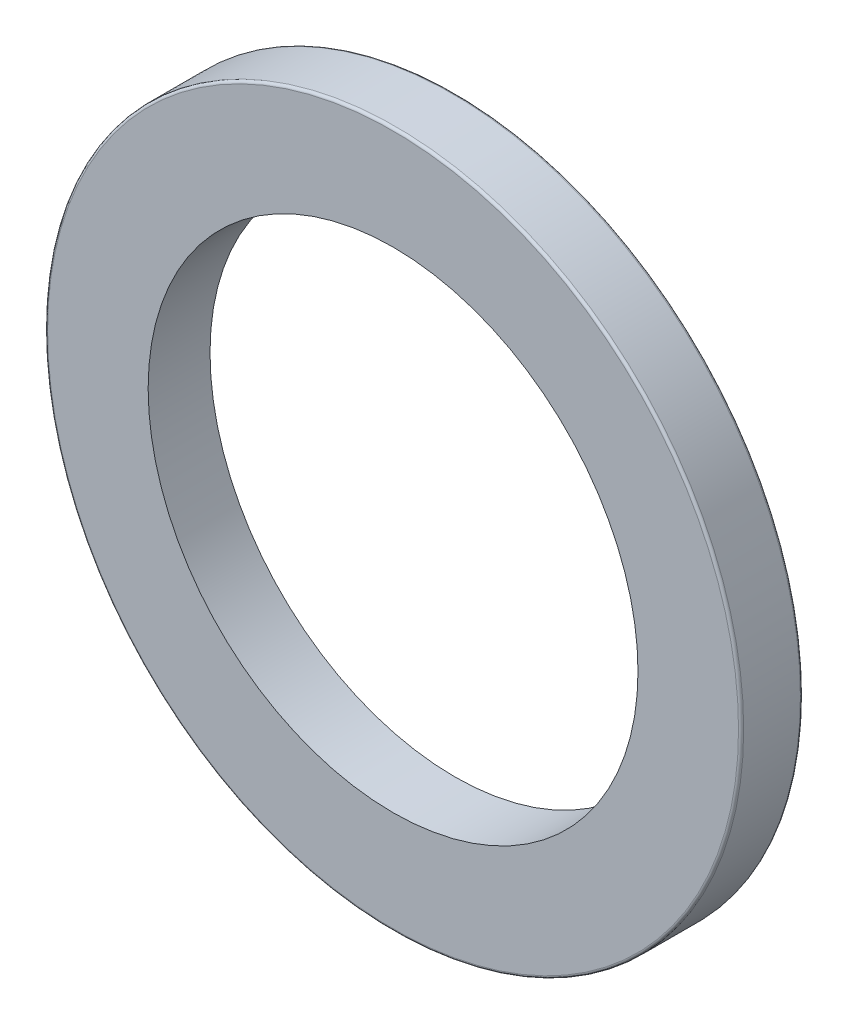
ISO-10303-21;
HEADER;
FILE_DESCRIPTION(('STEP AP214'),'2;1');
FILE_NAME('part.step','',(''),(''),'','','');
FILE_SCHEMA(('AUTOMOTIVE_DESIGN { 1 0 10303 214 1 1 1 1 }'));
ENDSEC;
DATA;
#1=APPLICATION_CONTEXT('core data for automotive mechanical design processes');
#2=APPLICATION_PROTOCOL_DEFINITION('international standard','automotive_design',2000,#1);
#3=PRODUCT_CONTEXT('',#1,'mechanical');
#4=PRODUCT('Part','Part','',(#3));
#5=PRODUCT_RELATED_PRODUCT_CATEGORY('part','',(#4));
#6=PRODUCT_DEFINITION_FORMATION('','',#4);
#7=PRODUCT_DEFINITION_CONTEXT('part definition',#1,'design');
#8=PRODUCT_DEFINITION('design','',#6,#7);
#9=PRODUCT_DEFINITION_SHAPE('','',#8);
#10=(LENGTH_UNIT() NAMED_UNIT(*) SI_UNIT(.MILLI.,.METRE.));
#11=(NAMED_UNIT(*) PLANE_ANGLE_UNIT() SI_UNIT($,.RADIAN.));
#12=(NAMED_UNIT(*) SI_UNIT($,.STERADIAN.) SOLID_ANGLE_UNIT());
#13=UNCERTAINTY_MEASURE_WITH_UNIT(LENGTH_MEASURE(1.E-05),#10,'distance_accuracy_value','');
#14=(GEOMETRIC_REPRESENTATION_CONTEXT(3) GLOBAL_UNCERTAINTY_ASSIGNED_CONTEXT((#13)) GLOBAL_UNIT_ASSIGNED_CONTEXT((#10,
#11,#12)) REPRESENTATION_CONTEXT('',''));
#15=CARTESIAN_POINT('',(0.,0.,0.));
#16=DIRECTION('',(0.,0.,1.));
#17=DIRECTION('',(1.,0.,0.));
#18=AXIS2_PLACEMENT_3D('',#15,#16,#17);
#19=CARTESIAN_POINT('',(0.,0.,12.));
#20=DIRECTION('',(0.,0.,1.));
#21=DIRECTION('',(1.,0.,0.));
#22=AXIS2_PLACEMENT_3D('',#19,#20,#21);
#23=PLANE('',#22);
#24=CARTESIAN_POINT('',(0.,0.,12.));
#25=DIRECTION('',(0.,0.,1.));
#26=DIRECTION('',(1.,0.,0.));
#27=AXIS2_PLACEMENT_3D('',#24,#25,#26);
#28=CIRCLE('',#27,67.);
#29=CARTESIAN_POINT('',(67.,0.,12.));
#30=VERTEX_POINT('',#29);
#31=EDGE_CURVE('E10',#30,#30,#28,.T.);
#32=ORIENTED_EDGE('',*,*,#31,.T.);
#33=EDGE_LOOP('',(#32));
#34=FACE_BOUND('',#33,.T.);
#35=CARTESIAN_POINT('',(0.,0.,12.));
#36=DIRECTION('',(0.,0.,1.));
#37=DIRECTION('',(1.,0.,0.));
#38=AXIS2_PLACEMENT_3D('',#35,#36,#37);
#39=CIRCLE('',#38,47.5);
#40=CARTESIAN_POINT('',(47.5,0.,12.));
#41=VERTEX_POINT('',#40);
#42=EDGE_CURVE('E61',#41,#41,#39,.T.);
#43=ORIENTED_EDGE('',*,*,#42,.F.);
#44=EDGE_LOOP('',(#43));
#45=FACE_BOUND('',#44,.T.);
#46=ADVANCED_FACE('F37',(#34,#45),#23,.T.);
#47=CARTESIAN_POINT('',(0.,0.,0.));
#48=DIRECTION('',(0.,0.,1.));
#49=DIRECTION('',(1.,0.,0.));
#50=AXIS2_PLACEMENT_3D('',#47,#48,#49);
#51=PLANE('',#50);
#52=CARTESIAN_POINT('',(0.,0.,0.));
#53=DIRECTION('',(0.,0.,1.));
#54=DIRECTION('',(1.,0.,0.));
#55=AXIS2_PLACEMENT_3D('',#52,#53,#54);
#56=CIRCLE('',#55,67.);
#57=CARTESIAN_POINT('',(67.,0.,0.));
#58=VERTEX_POINT('',#57);
#59=EDGE_CURVE('E45',#58,#58,#56,.F.);
#60=ORIENTED_EDGE('',*,*,#59,.T.);
#61=EDGE_LOOP('',(#60));
#62=FACE_BOUND('',#61,.T.);
#63=CARTESIAN_POINT('',(0.,0.,0.));
#64=DIRECTION('',(0.,0.,1.));
#65=DIRECTION('',(1.,0.,0.));
#66=AXIS2_PLACEMENT_3D('',#63,#64,#65);
#67=CIRCLE('',#66,47.5);
#68=CARTESIAN_POINT('',(47.5,0.,0.));
#69=VERTEX_POINT('',#68);
#70=EDGE_CURVE('E62',#69,#69,#67,.T.);
#71=ORIENTED_EDGE('',*,*,#70,.T.);
#72=EDGE_LOOP('',(#71));
#73=FACE_BOUND('',#72,.T.);
#74=ADVANCED_FACE('F74',(#62,#73),#51,.F.);
#75=CARTESIAN_POINT('',(0.,0.,12.));
#76=DIRECTION('',(0.,0.,-1.));
#77=DIRECTION('',(-1.,0.,0.));
#78=AXIS2_PLACEMENT_3D('',#75,#76,#77);
#79=CYLINDRICAL_SURFACE('',#78,67.5);
#80=CARTESIAN_POINT('',(0.,0.,0.5));
#81=DIRECTION('',(0.,0.,1.));
#82=DIRECTION('',(1.,0.,0.));
#83=AXIS2_PLACEMENT_3D('',#80,#81,#82);
#84=CIRCLE('',#83,67.5);
#85=CARTESIAN_POINT('',(67.5,0.,0.5));
#86=VERTEX_POINT('',#85);
#87=EDGE_CURVE('E50',#86,#86,#84,.T.);
#88=ORIENTED_EDGE('',*,*,#87,.T.);
#89=EDGE_LOOP('',(#88));
#90=FACE_BOUND('',#89,.T.);
#91=CARTESIAN_POINT('',(0.,0.,11.5));
#92=DIRECTION('',(0.,0.,1.));
#93=DIRECTION('',(1.,0.,0.));
#94=AXIS2_PLACEMENT_3D('',#91,#92,#93);
#95=CIRCLE('',#94,67.5);
#96=CARTESIAN_POINT('',(67.5,0.,11.5));
#97=VERTEX_POINT('',#96);
#98=EDGE_CURVE('E55',#97,#97,#95,.F.);
#99=ORIENTED_EDGE('',*,*,#98,.T.);
#100=EDGE_LOOP('',(#99));
#101=FACE_BOUND('',#100,.T.);
#102=ADVANCED_FACE('F79',(#90,#101),#79,.T.);
#103=CARTESIAN_POINT('',(0.,0.,12.));
#104=DIRECTION('',(0.,0.,-1.));
#105=DIRECTION('',(-1.,0.,0.));
#106=AXIS2_PLACEMENT_3D('',#103,#104,#105);
#107=CYLINDRICAL_SURFACE('',#106,47.5);
#108=ORIENTED_EDGE('',*,*,#42,.T.);
#109=EDGE_LOOP('',(#108));
#110=FACE_BOUND('',#109,.T.);
#111=ORIENTED_EDGE('',*,*,#70,.F.);
#112=EDGE_LOOP('',(#111));
#113=FACE_BOUND('',#112,.T.);
#114=ADVANCED_FACE('F70',(#110,#113),#107,.F.);
#115=CARTESIAN_POINT('',(0.,0.,0.5));
#116=DIRECTION('',(0.,0.,1.));
#117=DIRECTION('',(1.,0.,0.));
#118=AXIS2_PLACEMENT_3D('',#115,#116,#117);
#119=TOROIDAL_SURFACE('',#118,67.,0.5);
#120=ORIENTED_EDGE('',*,*,#59,.F.);
#121=EDGE_LOOP('',(#120));
#122=FACE_BOUND('',#121,.T.);
#123=ORIENTED_EDGE('',*,*,#87,.F.);
#124=EDGE_LOOP('',(#123));
#125=FACE_BOUND('',#124,.T.);
#126=ADVANCED_FACE('F85',(#122,#125),#119,.T.);
#127=CARTESIAN_POINT('',(0.,0.,11.5));
#128=DIRECTION('',(0.,0.,1.));
#129=DIRECTION('',(1.,0.,0.));
#130=AXIS2_PLACEMENT_3D('',#127,#128,#129);
#131=TOROIDAL_SURFACE('',#130,67.,0.5);
#132=ORIENTED_EDGE('',*,*,#98,.F.);
#133=EDGE_LOOP('',(#132));
#134=FACE_BOUND('',#133,.T.);
#135=ORIENTED_EDGE('',*,*,#31,.F.);
#136=EDGE_LOOP('',(#135));
#137=FACE_BOUND('',#136,.T.);
#138=ADVANCED_FACE('F39',(#134,#137),#131,.T.);
#139=CLOSED_SHELL('',(#46,#74,#102,#114,#126,#138));
#140=MANIFOLD_SOLID_BREP('B2',#139);
#141=ADVANCED_BREP_SHAPE_REPRESENTATION('',(#18,#140),#14);
#142=SHAPE_DEFINITION_REPRESENTATION(#9,#141);
ENDSEC;
END-ISO-10303-21;
